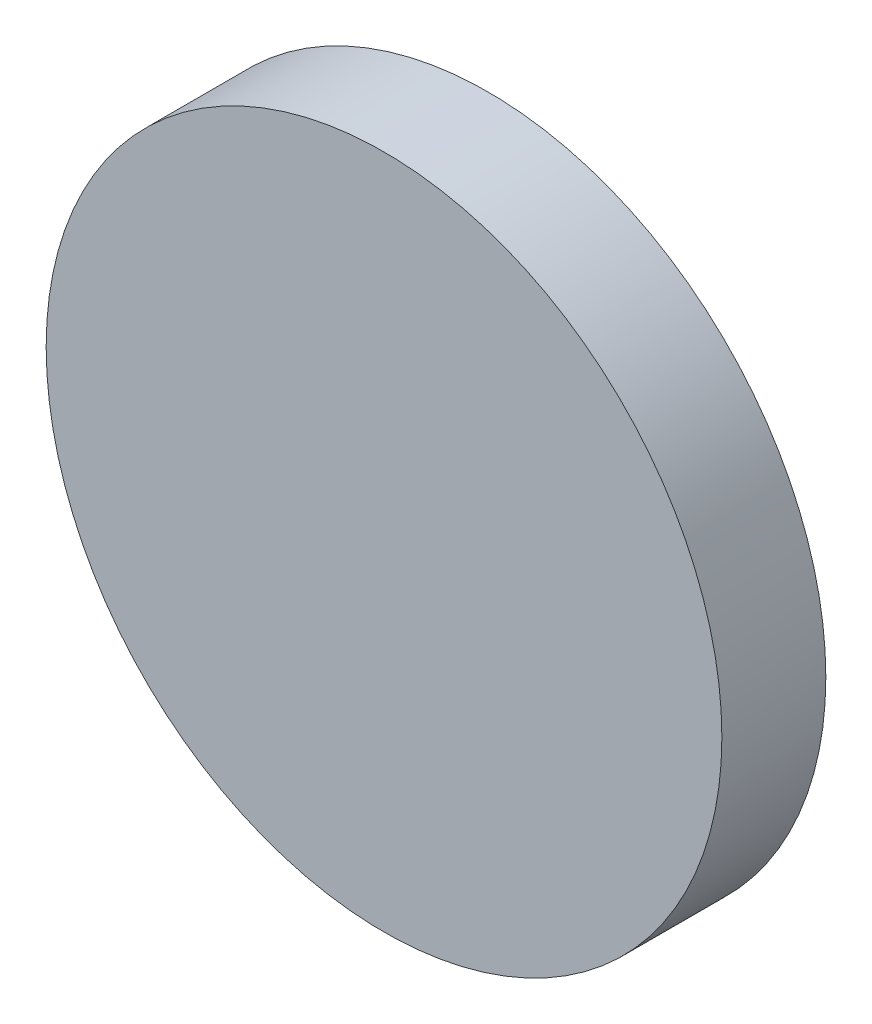
ISO-10303-21;
HEADER;
FILE_DESCRIPTION(('STEP AP214'),'2;1');
FILE_NAME('part.step','',(''),(''),'','','');
FILE_SCHEMA(('AUTOMOTIVE_DESIGN { 1 0 10303 214 1 1 1 1 }'));
ENDSEC;
DATA;
#1=APPLICATION_CONTEXT('core data for automotive mechanical design processes');
#2=APPLICATION_PROTOCOL_DEFINITION('international standard','automotive_design',2000,#1);
#3=PRODUCT_CONTEXT('',#1,'mechanical');
#4=PRODUCT('Part','Part','',(#3));
#5=PRODUCT_RELATED_PRODUCT_CATEGORY('part','',(#4));
#6=PRODUCT_DEFINITION_FORMATION('','',#4);
#7=PRODUCT_DEFINITION_CONTEXT('part definition',#1,'design');
#8=PRODUCT_DEFINITION('design','',#6,#7);
#9=PRODUCT_DEFINITION_SHAPE('','',#8);
#10=(LENGTH_UNIT() NAMED_UNIT(*) SI_UNIT(.MILLI.,.METRE.));
#11=(NAMED_UNIT(*) PLANE_ANGLE_UNIT() SI_UNIT($,.RADIAN.));
#12=(NAMED_UNIT(*) SI_UNIT($,.STERADIAN.) SOLID_ANGLE_UNIT());
#13=UNCERTAINTY_MEASURE_WITH_UNIT(LENGTH_MEASURE(1.E-05),#10,'distance_accuracy_value','');
#14=(GEOMETRIC_REPRESENTATION_CONTEXT(3) GLOBAL_UNCERTAINTY_ASSIGNED_CONTEXT((#13)) GLOBAL_UNIT_ASSIGNED_CONTEXT((#10,
#11,#12)) REPRESENTATION_CONTEXT('',''));
#15=CARTESIAN_POINT('',(0.,0.,0.));
#16=DIRECTION('',(0.,0.,1.));
#17=DIRECTION('',(1.,0.,0.));
#18=AXIS2_PLACEMENT_3D('',#15,#16,#17);
#19=CARTESIAN_POINT('',(-26.1199218573924,17.9896202093584,10.));
#20=DIRECTION('',(0.,0.,-1.));
#21=DIRECTION('',(-1.,0.,0.));
#22=AXIS2_PLACEMENT_3D('',#19,#20,#21);
#23=CYLINDRICAL_SURFACE('',#22,32.5);
#24=CARTESIAN_POINT('',(-26.1199218573924,17.9896202093584,10.));
#25=DIRECTION('',(0.,0.,1.));
#26=DIRECTION('',(1.,0.,0.));
#27=AXIS2_PLACEMENT_3D('',#24,#25,#26);
#28=CIRCLE('',#27,32.5);
#29=CARTESIAN_POINT('',(6.38007814260758,17.9896202093584,10.));
#30=VERTEX_POINT('',#29);
#31=EDGE_CURVE('E10',#30,#30,#28,.T.);
#32=ORIENTED_EDGE('',*,*,#31,.F.);
#33=EDGE_LOOP('',(#32));
#34=FACE_BOUND('',#33,.T.);
#35=CARTESIAN_POINT('',(-26.1199218573924,17.9896202093584,0.));
#36=DIRECTION('',(0.,0.,1.));
#37=DIRECTION('',(1.,0.,0.));
#38=AXIS2_PLACEMENT_3D('',#35,#36,#37);
#39=CIRCLE('',#38,32.5);
#40=CARTESIAN_POINT('',(6.38007814260758,17.9896202093584,0.));
#41=VERTEX_POINT('',#40);
#42=EDGE_CURVE('E40',#41,#41,#39,.T.);
#43=ORIENTED_EDGE('',*,*,#42,.T.);
#44=EDGE_LOOP('',(#43));
#45=FACE_BOUND('',#44,.T.);
#46=ADVANCED_FACE('F37',(#34,#45),#23,.T.);
#47=CARTESIAN_POINT('',(-26.1199218573924,17.9896202093584,10.));
#48=DIRECTION('',(0.,0.,1.));
#49=DIRECTION('',(1.,0.,0.));
#50=AXIS2_PLACEMENT_3D('',#47,#48,#49);
#51=PLANE('',#50);
#52=ORIENTED_EDGE('',*,*,#31,.T.);
#53=EDGE_LOOP('',(#52));
#54=FACE_BOUND('',#53,.T.);
#55=ADVANCED_FACE('F54',(#54),#51,.T.);
#56=CARTESIAN_POINT('',(-26.1199218573924,17.9896202093584,0.));
#57=DIRECTION('',(0.,0.,1.));
#58=DIRECTION('',(1.,0.,0.));
#59=AXIS2_PLACEMENT_3D('',#56,#57,#58);
#60=PLANE('',#59);
#61=ORIENTED_EDGE('',*,*,#42,.F.);
#62=EDGE_LOOP('',(#61));
#63=FACE_BOUND('',#62,.T.);
#64=ADVANCED_FACE('F52',(#63),#60,.F.);
#65=CLOSED_SHELL('',(#46,#55,#64));
#66=MANIFOLD_SOLID_BREP('B2',#65);
#67=ADVANCED_BREP_SHAPE_REPRESENTATION('',(#18,#66),#14);
#68=SHAPE_DEFINITION_REPRESENTATION(#9,#67);
ENDSEC;
END-ISO-10303-21;
